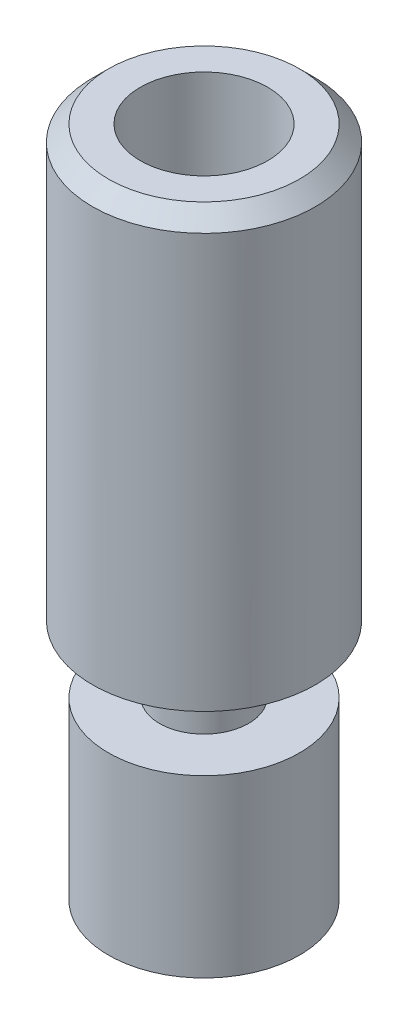
ISO-10303-21;
HEADER;
FILE_DESCRIPTION(('STEP AP214'),'2;1');
FILE_NAME('part.step','',(''),(''),'','','');
FILE_SCHEMA(('AUTOMOTIVE_DESIGN { 1 0 10303 214 1 1 1 1 }'));
ENDSEC;
DATA;
#1=APPLICATION_CONTEXT('core data for automotive mechanical design processes');
#2=APPLICATION_PROTOCOL_DEFINITION('international standard','automotive_design',2000,#1);
#3=PRODUCT_CONTEXT('',#1,'mechanical');
#4=PRODUCT('Part','Part','',(#3));
#5=PRODUCT_RELATED_PRODUCT_CATEGORY('part','',(#4));
#6=PRODUCT_DEFINITION_FORMATION('','',#4);
#7=PRODUCT_DEFINITION_CONTEXT('part definition',#1,'design');
#8=PRODUCT_DEFINITION('design','',#6,#7);
#9=PRODUCT_DEFINITION_SHAPE('','',#8);
#10=(LENGTH_UNIT() NAMED_UNIT(*) SI_UNIT(.MILLI.,.METRE.));
#11=(NAMED_UNIT(*) PLANE_ANGLE_UNIT() SI_UNIT($,.RADIAN.));
#12=(NAMED_UNIT(*) SI_UNIT($,.STERADIAN.) SOLID_ANGLE_UNIT());
#13=UNCERTAINTY_MEASURE_WITH_UNIT(LENGTH_MEASURE(1.E-05),#10,'distance_accuracy_value','');
#14=(GEOMETRIC_REPRESENTATION_CONTEXT(3) GLOBAL_UNCERTAINTY_ASSIGNED_CONTEXT((#13)) GLOBAL_UNIT_ASSIGNED_CONTEXT((#10,
#11,#12)) REPRESENTATION_CONTEXT('',''));
#15=CARTESIAN_POINT('',(0.,0.,0.));
#16=DIRECTION('',(0.,0.,1.));
#17=DIRECTION('',(1.,0.,0.));
#18=AXIS2_PLACEMENT_3D('',#15,#16,#17);
#19=CARTESIAN_POINT('',(0.,-10.55,0.));
#20=DIRECTION('',(0.,-1.,0.));
#21=DIRECTION('',(0.,0.,-1.));
#22=AXIS2_PLACEMENT_3D('',#19,#20,#21);
#23=CYLINDRICAL_SURFACE('',#22,3.);
#24=CARTESIAN_POINT('',(0.,-5.05,0.));
#25=DIRECTION('',(0.,-1.,0.));
#26=DIRECTION('',(0.,0.,-1.));
#27=AXIS2_PLACEMENT_3D('',#24,#25,#26);
#28=CIRCLE('',#27,3.);
#29=CARTESIAN_POINT('',(0.,-5.05,-3.));
#30=VERTEX_POINT('',#29);
#31=EDGE_CURVE('E41',#30,#30,#28,.T.);
#32=ORIENTED_EDGE('',*,*,#31,.T.);
#33=EDGE_LOOP('',(#32));
#34=FACE_BOUND('',#33,.T.);
#35=CARTESIAN_POINT('',(0.,-10.55,0.));
#36=DIRECTION('',(0.,-1.,0.));
#37=DIRECTION('',(0.,0.,-1.));
#38=AXIS2_PLACEMENT_3D('',#35,#36,#37);
#39=CIRCLE('',#38,3.);
#40=CARTESIAN_POINT('',(0.,-10.55,-3.));
#41=VERTEX_POINT('',#40);
#42=EDGE_CURVE('E68',#41,#41,#39,.T.);
#43=ORIENTED_EDGE('',*,*,#42,.F.);
#44=EDGE_LOOP('',(#43));
#45=FACE_BOUND('',#44,.T.);
#46=ADVANCED_FACE('F30',(#34,#45),#23,.T.);
#47=CARTESIAN_POINT('',(3.,-5.05,0.));
#48=DIRECTION('',(0.,1.,0.));
#49=DIRECTION('',(0.,0.,1.));
#50=AXIS2_PLACEMENT_3D('',#47,#48,#49);
#51=PLANE('',#50);
#52=CARTESIAN_POINT('',(0.,-5.05,0.));
#53=DIRECTION('',(0.,-1.,0.));
#54=DIRECTION('',(0.,0.,-1.));
#55=AXIS2_PLACEMENT_3D('',#52,#53,#54);
#56=CIRCLE('',#55,1.4);
#57=CARTESIAN_POINT('',(0.,-5.05,-1.4));
#58=VERTEX_POINT('',#57);
#59=EDGE_CURVE('E45',#58,#58,#56,.T.);
#60=ORIENTED_EDGE('',*,*,#59,.T.);
#61=EDGE_LOOP('',(#60));
#62=FACE_BOUND('',#61,.T.);
#63=ORIENTED_EDGE('',*,*,#31,.F.);
#64=EDGE_LOOP('',(#63));
#65=FACE_BOUND('',#64,.T.);
#66=ADVANCED_FACE('F76',(#62,#65),#51,.T.);
#67=CARTESIAN_POINT('',(0.,-10.55,0.));
#68=DIRECTION('',(0.,-1.,0.));
#69=DIRECTION('',(0.,0.,-1.));
#70=AXIS2_PLACEMENT_3D('',#67,#68,#69);
#71=CYLINDRICAL_SURFACE('',#70,1.4);
#72=CARTESIAN_POINT('',(0.,-2.95,0.));
#73=DIRECTION('',(0.,-1.,0.));
#74=DIRECTION('',(0.,0.,-1.));
#75=AXIS2_PLACEMENT_3D('',#72,#73,#74);
#76=CIRCLE('',#75,1.4);
#77=CARTESIAN_POINT('',(0.,-2.95,-1.4));
#78=VERTEX_POINT('',#77);
#79=EDGE_CURVE('E50',#78,#78,#76,.T.);
#80=ORIENTED_EDGE('',*,*,#79,.T.);
#81=EDGE_LOOP('',(#80));
#82=FACE_BOUND('',#81,.T.);
#83=ORIENTED_EDGE('',*,*,#59,.F.);
#84=EDGE_LOOP('',(#83));
#85=FACE_BOUND('',#84,.T.);
#86=ADVANCED_FACE('F81',(#82,#85),#71,.T.);
#87=CARTESIAN_POINT('',(1.4,-2.95,0.));
#88=DIRECTION('',(0.,-1.,0.));
#89=DIRECTION('',(0.,0.,-1.));
#90=AXIS2_PLACEMENT_3D('',#87,#88,#89);
#91=PLANE('',#90);
#92=CARTESIAN_POINT('',(0.,-2.95,0.));
#93=DIRECTION('',(0.,-1.,0.));
#94=DIRECTION('',(0.,0.,-1.));
#95=AXIS2_PLACEMENT_3D('',#92,#93,#94);
#96=CIRCLE('',#95,3.5);
#97=CARTESIAN_POINT('',(0.,-2.95,-3.5));
#98=VERTEX_POINT('',#97);
#99=EDGE_CURVE('E53',#98,#98,#96,.T.);
#100=ORIENTED_EDGE('',*,*,#99,.T.);
#101=EDGE_LOOP('',(#100));
#102=FACE_BOUND('',#101,.T.);
#103=ORIENTED_EDGE('',*,*,#79,.F.);
#104=EDGE_LOOP('',(#103));
#105=FACE_BOUND('',#104,.T.);
#106=ADVANCED_FACE('F87',(#102,#105),#91,.T.);
#107=CARTESIAN_POINT('',(0.,-10.55,0.));
#108=DIRECTION('',(0.,-1.,0.));
#109=DIRECTION('',(0.,0.,-1.));
#110=AXIS2_PLACEMENT_3D('',#107,#108,#109);
#111=CYLINDRICAL_SURFACE('',#110,3.5);
#112=CARTESIAN_POINT('',(0.,10.05,0.));
#113=DIRECTION('',(0.,1.,0.));
#114=DIRECTION('',(0.,0.,1.));
#115=AXIS2_PLACEMENT_3D('',#112,#113,#114);
#116=CIRCLE('',#115,3.5);
#117=CARTESIAN_POINT('',(0.,10.05,3.5));
#118=VERTEX_POINT('',#117);
#119=EDGE_CURVE('E37',#118,#118,#116,.F.);
#120=ORIENTED_EDGE('',*,*,#119,.T.);
#121=EDGE_LOOP('',(#120));
#122=FACE_BOUND('',#121,.T.);
#123=ORIENTED_EDGE('',*,*,#99,.F.);
#124=EDGE_LOOP('',(#123));
#125=FACE_BOUND('',#124,.T.);
#126=ADVANCED_FACE('F91',(#122,#125),#111,.T.);
#127=CARTESIAN_POINT('',(3.5,10.55,0.));
#128=DIRECTION('',(0.,1.,0.));
#129=DIRECTION('',(0.,0.,1.));
#130=AXIS2_PLACEMENT_3D('',#127,#128,#129);
#131=PLANE('',#130);
#132=CARTESIAN_POINT('',(0.,10.55,0.));
#133=DIRECTION('',(0.,1.,0.));
#134=DIRECTION('',(0.,0.,1.));
#135=AXIS2_PLACEMENT_3D('',#132,#133,#134);
#136=CIRCLE('',#135,3.);
#137=CARTESIAN_POINT('',(0.,10.55,3.));
#138=VERTEX_POINT('',#137);
#139=EDGE_CURVE('E10',#138,#138,#136,.T.);
#140=ORIENTED_EDGE('',*,*,#139,.T.);
#141=EDGE_LOOP('',(#140));
#142=FACE_BOUND('',#141,.T.);
#143=CARTESIAN_POINT('',(0.,10.55,0.));
#144=DIRECTION('',(0.,-1.,0.));
#145=DIRECTION('',(0.,0.,-1.));
#146=AXIS2_PLACEMENT_3D('',#143,#144,#145);
#147=CIRCLE('',#146,2.);
#148=CARTESIAN_POINT('',(0.,10.55,-2.));
#149=VERTEX_POINT('',#148);
#150=EDGE_CURVE('E56',#149,#149,#147,.T.);
#151=ORIENTED_EDGE('',*,*,#150,.T.);
#152=EDGE_LOOP('',(#151));
#153=FACE_BOUND('',#152,.T.);
#154=ADVANCED_FACE('F95',(#142,#153),#131,.T.);
#155=CARTESIAN_POINT('',(0.,-10.55,0.));
#156=DIRECTION('',(0.,-1.,0.));
#157=DIRECTION('',(0.,0.,-1.));
#158=AXIS2_PLACEMENT_3D('',#155,#156,#157);
#159=CYLINDRICAL_SURFACE('',#158,2.);
#160=CARTESIAN_POINT('',(0.,6.55,0.));
#161=DIRECTION('',(0.,-1.,0.));
#162=DIRECTION('',(0.,0.,-1.));
#163=AXIS2_PLACEMENT_3D('',#160,#161,#162);
#164=CIRCLE('',#163,2.);
#165=CARTESIAN_POINT('',(0.,6.55,-2.));
#166=VERTEX_POINT('',#165);
#167=EDGE_CURVE('E59',#166,#166,#164,.T.);
#168=ORIENTED_EDGE('',*,*,#167,.T.);
#169=EDGE_LOOP('',(#168));
#170=FACE_BOUND('',#169,.T.);
#171=ORIENTED_EDGE('',*,*,#150,.F.);
#172=EDGE_LOOP('',(#171));
#173=FACE_BOUND('',#172,.T.);
#174=ADVANCED_FACE('F98',(#170,#173),#159,.F.);
#175=CARTESIAN_POINT('',(0.,6.55,0.));
#176=DIRECTION('',(0.,1.,0.));
#177=DIRECTION('',(0.,0.,1.));
#178=AXIS2_PLACEMENT_3D('',#175,#176,#177);
#179=CONICAL_SURFACE('',#178,2.,1.0471975511966);
#180=CARTESIAN_POINT('',(0.,5.97264973081038,0.));
#181=DIRECTION('',(0.,-1.,0.));
#182=DIRECTION('',(0.,0.,-1.));
#183=AXIS2_PLACEMENT_3D('',#180,#181,#182);
#184=CIRCLE('',#183,1.);
#185=CARTESIAN_POINT('',(0.,5.97264973081038,-1.));
#186=VERTEX_POINT('',#185);
#187=EDGE_CURVE('E62',#186,#186,#184,.T.);
#188=ORIENTED_EDGE('',*,*,#187,.T.);
#189=EDGE_LOOP('',(#188));
#190=FACE_BOUND('',#189,.T.);
#191=ORIENTED_EDGE('',*,*,#167,.F.);
#192=EDGE_LOOP('',(#191));
#193=FACE_BOUND('',#192,.T.);
#194=ADVANCED_FACE('F101',(#190,#193),#179,.F.);
#195=CARTESIAN_POINT('',(0.,-10.55,0.));
#196=DIRECTION('',(0.,-1.,0.));
#197=DIRECTION('',(0.,0.,-1.));
#198=AXIS2_PLACEMENT_3D('',#195,#196,#197);
#199=CYLINDRICAL_SURFACE('',#198,1.);
#200=CARTESIAN_POINT('',(0.,-10.55,0.));
#201=DIRECTION('',(0.,-1.,0.));
#202=DIRECTION('',(0.,0.,-1.));
#203=AXIS2_PLACEMENT_3D('',#200,#201,#202);
#204=CIRCLE('',#203,1.);
#205=CARTESIAN_POINT('',(0.,-10.55,-1.));
#206=VERTEX_POINT('',#205);
#207=EDGE_CURVE('E65',#206,#206,#204,.T.);
#208=ORIENTED_EDGE('',*,*,#207,.T.);
#209=EDGE_LOOP('',(#208));
#210=FACE_BOUND('',#209,.T.);
#211=ORIENTED_EDGE('',*,*,#187,.F.);
#212=EDGE_LOOP('',(#211));
#213=FACE_BOUND('',#212,.T.);
#214=ADVANCED_FACE('F105',(#210,#213),#199,.F.);
#215=CARTESIAN_POINT('',(1.,-10.55,0.));
#216=DIRECTION('',(0.,-1.,0.));
#217=DIRECTION('',(0.,0.,-1.));
#218=AXIS2_PLACEMENT_3D('',#215,#216,#217);
#219=PLANE('',#218);
#220=ORIENTED_EDGE('',*,*,#42,.T.);
#221=EDGE_LOOP('',(#220));
#222=FACE_BOUND('',#221,.T.);
#223=ORIENTED_EDGE('',*,*,#207,.F.);
#224=EDGE_LOOP('',(#223));
#225=FACE_BOUND('',#224,.T.);
#226=ADVANCED_FACE('F72',(#222,#225),#219,.T.);
#227=CARTESIAN_POINT('',(0.,10.05,0.));
#228=DIRECTION('',(0.,-1.,0.));
#229=DIRECTION('',(0.,0.,-1.));
#230=AXIS2_PLACEMENT_3D('',#227,#228,#229);
#231=CONICAL_SURFACE('',#230,3.5,0.785398163397446);
#232=ORIENTED_EDGE('',*,*,#139,.F.);
#233=EDGE_LOOP('',(#232));
#234=FACE_BOUND('',#233,.T.);
#235=ORIENTED_EDGE('',*,*,#119,.F.);
#236=EDGE_LOOP('',(#235));
#237=FACE_BOUND('',#236,.T.);
#238=ADVANCED_FACE('F32',(#234,#237),#231,.T.);
#239=CLOSED_SHELL('',(#46,#66,#86,#106,#126,#154,#174,#194,#214,#226,#238));
#240=MANIFOLD_SOLID_BREP('B2',#239);
#241=ADVANCED_BREP_SHAPE_REPRESENTATION('',(#18,#240),#14);
#242=SHAPE_DEFINITION_REPRESENTATION(#9,#241);
ENDSEC;
END-ISO-10303-21;
